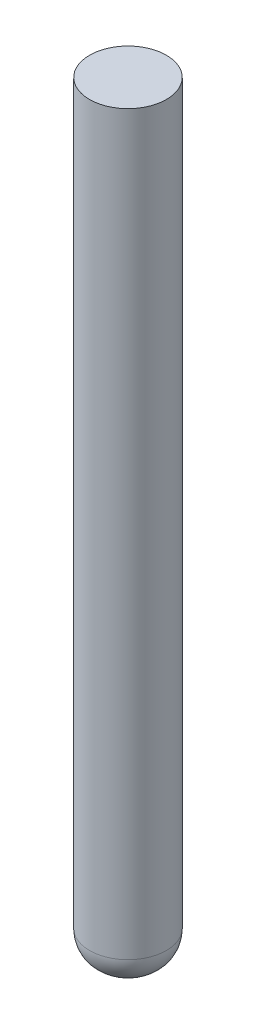
ISO-10303-21;
HEADER;
FILE_DESCRIPTION(('STEP AP214'),'2;1');
FILE_NAME('part.step','',(''),(''),'','','');
FILE_SCHEMA(('AUTOMOTIVE_DESIGN { 1 0 10303 214 1 1 1 1 }'));
ENDSEC;
DATA;
#1=APPLICATION_CONTEXT('core data for automotive mechanical design processes');
#2=APPLICATION_PROTOCOL_DEFINITION('international standard','automotive_design',2000,#1);
#3=PRODUCT_CONTEXT('',#1,'mechanical');
#4=PRODUCT('Part','Part','',(#3));
#5=PRODUCT_RELATED_PRODUCT_CATEGORY('part','',(#4));
#6=PRODUCT_DEFINITION_FORMATION('','',#4);
#7=PRODUCT_DEFINITION_CONTEXT('part definition',#1,'design');
#8=PRODUCT_DEFINITION('design','',#6,#7);
#9=PRODUCT_DEFINITION_SHAPE('','',#8);
#10=(LENGTH_UNIT() NAMED_UNIT(*) SI_UNIT(.MILLI.,.METRE.));
#11=(NAMED_UNIT(*) PLANE_ANGLE_UNIT() SI_UNIT($,.RADIAN.));
#12=(NAMED_UNIT(*) SI_UNIT($,.STERADIAN.) SOLID_ANGLE_UNIT());
#13=UNCERTAINTY_MEASURE_WITH_UNIT(LENGTH_MEASURE(1.E-05),#10,'distance_accuracy_value','');
#14=(GEOMETRIC_REPRESENTATION_CONTEXT(3) GLOBAL_UNCERTAINTY_ASSIGNED_CONTEXT((#13)) GLOBAL_UNIT_ASSIGNED_CONTEXT((#10,
#11,#12)) REPRESENTATION_CONTEXT('',''));
#15=CARTESIAN_POINT('',(0.,0.,0.));
#16=DIRECTION('',(0.,0.,1.));
#17=DIRECTION('',(1.,0.,0.));
#18=AXIS2_PLACEMENT_3D('',#15,#16,#17);
#19=CARTESIAN_POINT('',(0.,0.,0.));
#20=DIRECTION('',(0.,1.,0.));
#21=DIRECTION('',(0.,0.,1.));
#22=AXIS2_PLACEMENT_3D('',#19,#20,#21);
#23=PLANE('',#22);
#24=CARTESIAN_POINT('',(0.,0.,0.));
#25=DIRECTION('',(0.,1.,0.));
#26=DIRECTION('',(0.,0.,1.));
#27=AXIS2_PLACEMENT_3D('',#24,#25,#26);
#28=CIRCLE('',#27,0.05);
#29=CARTESIAN_POINT('',(0.,0.,0.05));
#30=VERTEX_POINT('',#29);
#31=EDGE_CURVE('E9',#30,#30,#28,.F.);
#32=ORIENTED_EDGE('',*,*,#31,.T.);
#33=EDGE_LOOP('',(#32));
#34=FACE_BOUND('',#33,.T.);
#35=ADVANCED_FACE('F14',(#34),#23,.F.);
#36=CARTESIAN_POINT('',(0.,5.,0.));
#37=DIRECTION('',(0.,1.,0.));
#38=DIRECTION('',(0.,0.,1.));
#39=AXIS2_PLACEMENT_3D('',#36,#37,#38);
#40=PLANE('',#39);
#41=CARTESIAN_POINT('',(0.,5.,0.));
#42=DIRECTION('',(0.,1.,0.));
#43=DIRECTION('',(0.,0.,1.));
#44=AXIS2_PLACEMENT_3D('',#41,#42,#43);
#45=CIRCLE('',#44,0.25);
#46=CARTESIAN_POINT('',(0.,5.,0.25));
#47=VERTEX_POINT('',#46);
#48=EDGE_CURVE('E25',#47,#47,#45,.T.);
#49=ORIENTED_EDGE('',*,*,#48,.T.);
#50=EDGE_LOOP('',(#49));
#51=FACE_BOUND('',#50,.T.);
#52=ADVANCED_FACE('F32',(#51),#40,.T.);
#53=CARTESIAN_POINT('',(0.,0.,0.));
#54=DIRECTION('',(0.,1.,0.));
#55=DIRECTION('',(-1.,0.,0.));
#56=AXIS2_PLACEMENT_3D('',#53,#54,#55);
#57=CYLINDRICAL_SURFACE('',#56,0.25);
#58=CARTESIAN_POINT('',(0.,0.2,0.));
#59=DIRECTION('',(0.,1.,0.));
#60=DIRECTION('',(0.,0.,1.));
#61=AXIS2_PLACEMENT_3D('',#58,#59,#60);
#62=CIRCLE('',#61,0.25);
#63=CARTESIAN_POINT('',(0.,0.2,0.25));
#64=VERTEX_POINT('',#63);
#65=EDGE_CURVE('E21',#64,#64,#62,.T.);
#66=ORIENTED_EDGE('',*,*,#65,.T.);
#67=EDGE_LOOP('',(#66));
#68=FACE_BOUND('',#67,.T.);
#69=ORIENTED_EDGE('',*,*,#48,.F.);
#70=EDGE_LOOP('',(#69));
#71=FACE_BOUND('',#70,.T.);
#72=ADVANCED_FACE('F34',(#68,#71),#57,.T.);
#73=CARTESIAN_POINT('',(0.,0.2,0.));
#74=DIRECTION('',(0.,1.,0.));
#75=DIRECTION('',(0.,0.,1.));
#76=AXIS2_PLACEMENT_3D('',#73,#74,#75);
#77=DEGENERATE_TOROIDAL_SURFACE('',#76,0.05,0.2,.T.);
#78=ORIENTED_EDGE('',*,*,#31,.F.);
#79=EDGE_LOOP('',(#78));
#80=FACE_BOUND('',#79,.T.);
#81=ORIENTED_EDGE('',*,*,#65,.F.);
#82=EDGE_LOOP('',(#81));
#83=FACE_BOUND('',#82,.T.);
#84=ADVANCED_FACE('F16',(#80,#83),#77,.T.);
#85=CLOSED_SHELL('',(#35,#52,#72,#84));
#86=MANIFOLD_SOLID_BREP('B1',#85);
#87=ADVANCED_BREP_SHAPE_REPRESENTATION('',(#18,#86),#14);
#88=SHAPE_DEFINITION_REPRESENTATION(#9,#87);
ENDSEC;
END-ISO-10303-21;
